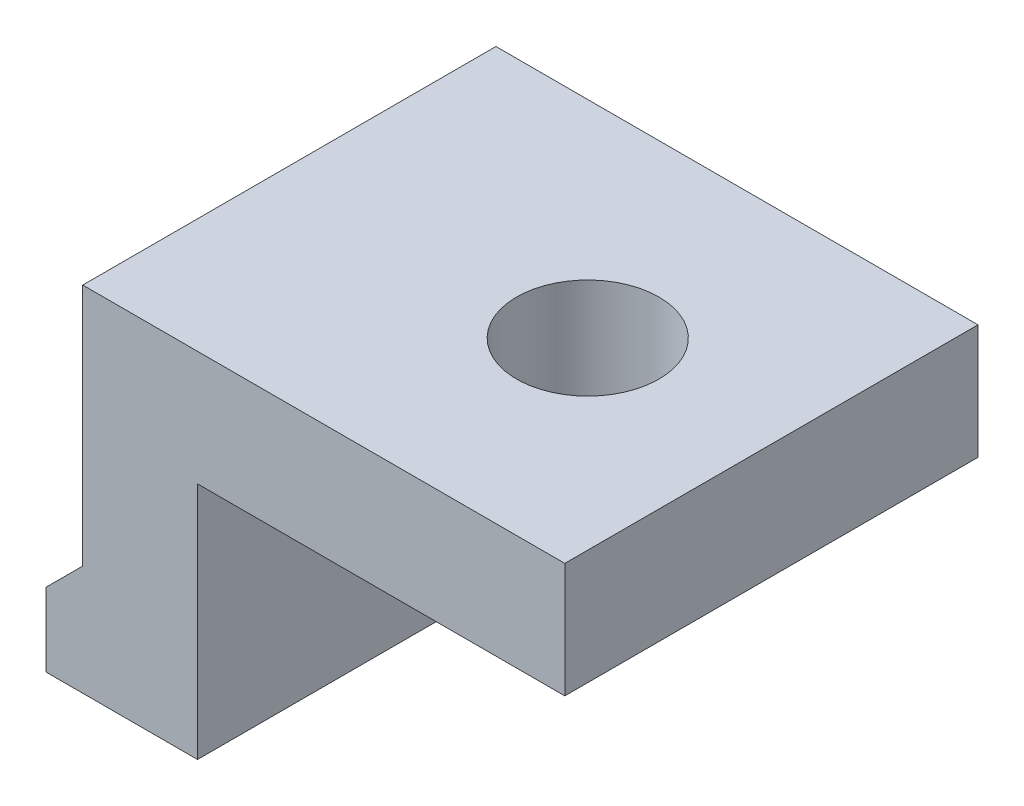
ISO-10303-21;
HEADER;
FILE_DESCRIPTION(('STEP AP214'),'2;1');
FILE_NAME('part.step','',(''),(''),'','','');
FILE_SCHEMA(('AUTOMOTIVE_DESIGN { 1 0 10303 214 1 1 1 1 }'));
ENDSEC;
DATA;
#1=APPLICATION_CONTEXT('core data for automotive mechanical design processes');
#2=APPLICATION_PROTOCOL_DEFINITION('international standard','automotive_design',2000,#1);
#3=PRODUCT_CONTEXT('',#1,'mechanical');
#4=PRODUCT('Part','Part','',(#3));
#5=PRODUCT_RELATED_PRODUCT_CATEGORY('part','',(#4));
#6=PRODUCT_DEFINITION_FORMATION('','',#4);
#7=PRODUCT_DEFINITION_CONTEXT('part definition',#1,'design');
#8=PRODUCT_DEFINITION('design','',#6,#7);
#9=PRODUCT_DEFINITION_SHAPE('','',#8);
#10=(LENGTH_UNIT() NAMED_UNIT(*) SI_UNIT(.MILLI.,.METRE.));
#11=(NAMED_UNIT(*) PLANE_ANGLE_UNIT() SI_UNIT($,.RADIAN.));
#12=(NAMED_UNIT(*) SI_UNIT($,.STERADIAN.) SOLID_ANGLE_UNIT());
#13=UNCERTAINTY_MEASURE_WITH_UNIT(LENGTH_MEASURE(1.E-05),#10,'distance_accuracy_value','');
#14=(GEOMETRIC_REPRESENTATION_CONTEXT(3) GLOBAL_UNCERTAINTY_ASSIGNED_CONTEXT((#13)) GLOBAL_UNIT_ASSIGNED_CONTEXT((#10,
#11,#12)) REPRESENTATION_CONTEXT('',''));
#15=CARTESIAN_POINT('',(0.,0.,0.));
#16=DIRECTION('',(0.,0.,1.));
#17=DIRECTION('',(1.,0.,0.));
#18=AXIS2_PLACEMENT_3D('',#15,#16,#17);
#19=CARTESIAN_POINT('',(8.,0.,9.));
#20=DIRECTION('',(1.,0.,0.));
#21=DIRECTION('',(0.,0.,-1.));
#22=AXIS2_PLACEMENT_3D('',#19,#20,#21);
#23=PLANE('',#22);
#24=DIRECTION('',(0.,-1.,0.));
#25=VECTOR('',#24,1.);
#26=CARTESIAN_POINT('',(8.,0.,0.));
#27=LINE('',#26,#25);
#28=CARTESIAN_POINT('',(8.,0.,0.));
#29=VERTEX_POINT('',#28);
#30=CARTESIAN_POINT('',(8.,-2.5,0.));
#31=VERTEX_POINT('',#30);
#32=EDGE_CURVE('E126',#29,#31,#27,.T.);
#33=ORIENTED_EDGE('',*,*,#32,.F.);
#34=DIRECTION('',(0.,0.,-1.));
#35=VECTOR('',#34,1.);
#36=CARTESIAN_POINT('',(8.,0.,9.));
#37=LINE('',#36,#35);
#38=CARTESIAN_POINT('',(8.,0.,9.));
#39=VERTEX_POINT('',#38);
#40=EDGE_CURVE('E11',#39,#29,#37,.T.);
#41=ORIENTED_EDGE('',*,*,#40,.F.);
#42=DIRECTION('',(0.,-1.,0.));
#43=VECTOR('',#42,1.);
#44=CARTESIAN_POINT('',(8.,0.,9.));
#45=LINE('',#44,#43);
#46=CARTESIAN_POINT('',(8.,-2.5,9.));
#47=VERTEX_POINT('',#46);
#48=EDGE_CURVE('E143',#39,#47,#45,.T.);
#49=ORIENTED_EDGE('',*,*,#48,.T.);
#50=DIRECTION('',(0.,0.,-1.));
#51=VECTOR('',#50,1.);
#52=CARTESIAN_POINT('',(8.,-2.5,9.));
#53=LINE('',#52,#51);
#54=EDGE_CURVE('E85',#47,#31,#53,.T.);
#55=ORIENTED_EDGE('',*,*,#54,.T.);
#56=EDGE_LOOP('',(#33,#41,#49,#55));
#57=FACE_BOUND('',#56,.T.);
#58=ADVANCED_FACE('F34',(#57),#23,.T.);
#59=CARTESIAN_POINT('',(0.,0.,9.));
#60=DIRECTION('',(0.,1.,0.));
#61=DIRECTION('',(0.,0.,1.));
#62=AXIS2_PLACEMENT_3D('',#59,#60,#61);
#63=PLANE('',#62);
#64=CARTESIAN_POINT('',(4.,0.,4.5));
#65=DIRECTION('',(0.,-1.,0.));
#66=DIRECTION('',(0.,0.,-1.));
#67=AXIS2_PLACEMENT_3D('',#64,#65,#66);
#68=CIRCLE('',#67,1.55);
#69=CARTESIAN_POINT('',(4.,0.,2.95));
#70=VERTEX_POINT('',#69);
#71=EDGE_CURVE('E130',#70,#70,#68,.T.);
#72=ORIENTED_EDGE('',*,*,#71,.T.);
#73=EDGE_LOOP('',(#72));
#74=FACE_BOUND('',#73,.T.);
#75=DIRECTION('',(1.,0.,0.));
#76=VECTOR('',#75,1.);
#77=CARTESIAN_POINT('',(0.,0.,0.));
#78=LINE('',#77,#76);
#79=CARTESIAN_POINT('',(-2.5,0.,0.));
#80=VERTEX_POINT('',#79);
#81=EDGE_CURVE('E129',#80,#29,#78,.T.);
#82=ORIENTED_EDGE('',*,*,#81,.F.);
#83=DIRECTION('',(0.,0.,-1.));
#84=VECTOR('',#83,1.);
#85=CARTESIAN_POINT('',(-2.5,0.,9.));
#86=LINE('',#85,#84);
#87=CARTESIAN_POINT('',(-2.5,0.,9.));
#88=VERTEX_POINT('',#87);
#89=EDGE_CURVE('E42',#88,#80,#86,.T.);
#90=ORIENTED_EDGE('',*,*,#89,.F.);
#91=DIRECTION('',(1.,0.,0.));
#92=VECTOR('',#91,1.);
#93=CARTESIAN_POINT('',(0.,0.,9.));
#94=LINE('',#93,#92);
#95=EDGE_CURVE('E167',#88,#39,#94,.T.);
#96=ORIENTED_EDGE('',*,*,#95,.T.);
#97=ORIENTED_EDGE('',*,*,#40,.T.);
#98=EDGE_LOOP('',(#82,#90,#96,#97));
#99=FACE_BOUND('',#98,.T.);
#100=ADVANCED_FACE('F166',(#74,#99),#63,.T.);
#101=CARTESIAN_POINT('',(-2.5,0.,9.));
#102=DIRECTION('',(1.,0.,0.));
#103=DIRECTION('',(0.,1.,0.));
#104=AXIS2_PLACEMENT_3D('',#101,#102,#103);
#105=PLANE('',#104);
#106=DIRECTION('',(0.,-1.,0.));
#107=VECTOR('',#106,1.);
#108=CARTESIAN_POINT('',(-2.5,0.,0.));
#109=LINE('',#108,#107);
#110=CARTESIAN_POINT('',(-2.5,-5.3,0.));
#111=VERTEX_POINT('',#110);
#112=EDGE_CURVE('E133',#80,#111,#109,.T.);
#113=ORIENTED_EDGE('',*,*,#112,.T.);
#114=DIRECTION('',(0.,0.,-1.));
#115=VECTOR('',#114,1.);
#116=CARTESIAN_POINT('',(-2.5,-5.3,9.));
#117=LINE('',#116,#115);
#118=CARTESIAN_POINT('',(-2.5,-5.3,9.));
#119=VERTEX_POINT('',#118);
#120=EDGE_CURVE('E150',#119,#111,#117,.T.);
#121=ORIENTED_EDGE('',*,*,#120,.F.);
#122=DIRECTION('',(0.,-1.,0.));
#123=VECTOR('',#122,1.);
#124=CARTESIAN_POINT('',(-2.5,0.,9.));
#125=LINE('',#124,#123);
#126=EDGE_CURVE('E157',#88,#119,#125,.T.);
#127=ORIENTED_EDGE('',*,*,#126,.F.);
#128=ORIENTED_EDGE('',*,*,#89,.T.);
#129=EDGE_LOOP('',(#113,#121,#127,#128));
#130=FACE_BOUND('',#129,.T.);
#131=ADVANCED_FACE('F155',(#130),#105,.F.);
#132=CARTESIAN_POINT('',(1.4,-1.40000000000001,9.));
#133=DIRECTION('',(0.707106781186547,-0.707106781186548,0.));
#134=DIRECTION('',(0.707106781186548,0.707106781186547,0.));
#135=AXIS2_PLACEMENT_3D('',#132,#133,#134);
#136=PLANE('',#135);
#137=DIRECTION('',(-0.707106781186548,-0.707106781186547,0.));
#138=VECTOR('',#137,1.);
#139=CARTESIAN_POINT('',(1.4,-1.40000000000001,0.));
#140=LINE('',#139,#138);
#141=CARTESIAN_POINT('',(-3.3,-6.1,0.));
#142=VERTEX_POINT('',#141);
#143=EDGE_CURVE('E135',#111,#142,#140,.T.);
#144=ORIENTED_EDGE('',*,*,#143,.T.);
#145=DIRECTION('',(0.,0.,-1.));
#146=VECTOR('',#145,1.);
#147=CARTESIAN_POINT('',(-3.3,-6.1,9.));
#148=LINE('',#147,#146);
#149=CARTESIAN_POINT('',(-3.3,-6.1,9.));
#150=VERTEX_POINT('',#149);
#151=EDGE_CURVE('E147',#150,#142,#148,.T.);
#152=ORIENTED_EDGE('',*,*,#151,.F.);
#153=DIRECTION('',(-0.707106781186548,-0.707106781186547,0.));
#154=VECTOR('',#153,1.);
#155=CARTESIAN_POINT('',(1.4,-1.40000000000001,9.));
#156=LINE('',#155,#154);
#157=EDGE_CURVE('E178',#119,#150,#156,.T.);
#158=ORIENTED_EDGE('',*,*,#157,.F.);
#159=ORIENTED_EDGE('',*,*,#120,.T.);
#160=EDGE_LOOP('',(#144,#152,#158,#159));
#161=FACE_BOUND('',#160,.T.);
#162=ADVANCED_FACE('F182',(#161),#136,.F.);
#163=CARTESIAN_POINT('',(-3.3,0.,9.));
#164=DIRECTION('',(1.,0.,0.));
#165=DIRECTION('',(0.,0.,-1.));
#166=AXIS2_PLACEMENT_3D('',#163,#164,#165);
#167=PLANE('',#166);
#168=DIRECTION('',(0.,-1.,0.));
#169=VECTOR('',#168,1.);
#170=CARTESIAN_POINT('',(-3.3,0.,0.));
#171=LINE('',#170,#169);
#172=CARTESIAN_POINT('',(-3.3,-7.7,0.));
#173=VERTEX_POINT('',#172);
#174=EDGE_CURVE('E137',#142,#173,#171,.T.);
#175=ORIENTED_EDGE('',*,*,#174,.T.);
#176=DIRECTION('',(0.,0.,-1.));
#177=VECTOR('',#176,1.);
#178=CARTESIAN_POINT('',(-3.3,-7.7,9.));
#179=LINE('',#178,#177);
#180=CARTESIAN_POINT('',(-3.3,-7.7,9.));
#181=VERTEX_POINT('',#180);
#182=EDGE_CURVE('E118',#181,#173,#179,.T.);
#183=ORIENTED_EDGE('',*,*,#182,.F.);
#184=DIRECTION('',(0.,-1.,0.));
#185=VECTOR('',#184,1.);
#186=CARTESIAN_POINT('',(-3.3,0.,9.));
#187=LINE('',#186,#185);
#188=EDGE_CURVE('E109',#150,#181,#187,.T.);
#189=ORIENTED_EDGE('',*,*,#188,.F.);
#190=ORIENTED_EDGE('',*,*,#151,.T.);
#191=EDGE_LOOP('',(#175,#183,#189,#190));
#192=FACE_BOUND('',#191,.T.);
#193=ADVANCED_FACE('F184',(#192),#167,.F.);
#194=CARTESIAN_POINT('',(0.,-7.7,9.));
#195=DIRECTION('',(0.,1.,0.));
#196=DIRECTION('',(0.,0.,1.));
#197=AXIS2_PLACEMENT_3D('',#194,#195,#196);
#198=PLANE('',#197);
#199=DIRECTION('',(1.,0.,0.));
#200=VECTOR('',#199,1.);
#201=CARTESIAN_POINT('',(0.,-7.7,0.));
#202=LINE('',#201,#200);
#203=CARTESIAN_POINT('',(0.,-7.7,0.));
#204=VERTEX_POINT('',#203);
#205=EDGE_CURVE('E117',#173,#204,#202,.T.);
#206=ORIENTED_EDGE('',*,*,#205,.T.);
#207=DIRECTION('',(0.,0.,-1.));
#208=VECTOR('',#207,1.);
#209=CARTESIAN_POINT('',(0.,-7.7,9.));
#210=LINE('',#209,#208);
#211=CARTESIAN_POINT('',(0.,-7.7,9.));
#212=VERTEX_POINT('',#211);
#213=EDGE_CURVE('E114',#212,#204,#210,.T.);
#214=ORIENTED_EDGE('',*,*,#213,.F.);
#215=DIRECTION('',(1.,0.,0.));
#216=VECTOR('',#215,1.);
#217=CARTESIAN_POINT('',(0.,-7.7,9.));
#218=LINE('',#217,#216);
#219=EDGE_CURVE('E103',#181,#212,#218,.T.);
#220=ORIENTED_EDGE('',*,*,#219,.F.);
#221=ORIENTED_EDGE('',*,*,#182,.T.);
#222=EDGE_LOOP('',(#206,#214,#220,#221));
#223=FACE_BOUND('',#222,.T.);
#224=ADVANCED_FACE('F115',(#223),#198,.F.);
#225=CARTESIAN_POINT('',(0.,0.,9.));
#226=DIRECTION('',(-1.,0.,0.));
#227=DIRECTION('',(0.,0.,1.));
#228=AXIS2_PLACEMENT_3D('',#225,#226,#227);
#229=PLANE('',#228);
#230=DIRECTION('',(0.,1.,0.));
#231=VECTOR('',#230,1.);
#232=CARTESIAN_POINT('',(0.,0.,0.));
#233=LINE('',#232,#231);
#234=CARTESIAN_POINT('',(0.,-2.5,0.));
#235=VERTEX_POINT('',#234);
#236=EDGE_CURVE('E78',#204,#235,#233,.T.);
#237=ORIENTED_EDGE('',*,*,#236,.T.);
#238=DIRECTION('',(0.,0.,-1.));
#239=VECTOR('',#238,1.);
#240=CARTESIAN_POINT('',(0.,-2.5,9.));
#241=LINE('',#240,#239);
#242=CARTESIAN_POINT('',(0.,-2.5,9.));
#243=VERTEX_POINT('',#242);
#244=EDGE_CURVE('E119',#243,#235,#241,.T.);
#245=ORIENTED_EDGE('',*,*,#244,.F.);
#246=DIRECTION('',(0.,1.,0.));
#247=VECTOR('',#246,1.);
#248=CARTESIAN_POINT('',(0.,0.,9.));
#249=LINE('',#248,#247);
#250=EDGE_CURVE('E107',#212,#243,#249,.T.);
#251=ORIENTED_EDGE('',*,*,#250,.F.);
#252=ORIENTED_EDGE('',*,*,#213,.T.);
#253=EDGE_LOOP('',(#237,#245,#251,#252));
#254=FACE_BOUND('',#253,.T.);
#255=ADVANCED_FACE('F121',(#254),#229,.F.);
#256=CARTESIAN_POINT('',(0.,-2.5,9.));
#257=DIRECTION('',(0.,1.,0.));
#258=DIRECTION('',(0.,0.,1.));
#259=AXIS2_PLACEMENT_3D('',#256,#257,#258);
#260=PLANE('',#259);
#261=CARTESIAN_POINT('',(4.,-2.5,4.5));
#262=DIRECTION('',(0.,-1.,0.));
#263=DIRECTION('',(0.,0.,-1.));
#264=AXIS2_PLACEMENT_3D('',#261,#262,#263);
#265=CIRCLE('',#264,1.55);
#266=CARTESIAN_POINT('',(4.,-2.5,2.95));
#267=VERTEX_POINT('',#266);
#268=EDGE_CURVE('E174',#267,#267,#265,.T.);
#269=ORIENTED_EDGE('',*,*,#268,.F.);
#270=EDGE_LOOP('',(#269));
#271=FACE_BOUND('',#270,.T.);
#272=DIRECTION('',(1.,0.,0.));
#273=VECTOR('',#272,1.);
#274=CARTESIAN_POINT('',(0.,-2.5,0.));
#275=LINE('',#274,#273);
#276=EDGE_CURVE('E141',#235,#31,#275,.T.);
#277=ORIENTED_EDGE('',*,*,#276,.T.);
#278=ORIENTED_EDGE('',*,*,#54,.F.);
#279=DIRECTION('',(1.,0.,0.));
#280=VECTOR('',#279,1.);
#281=CARTESIAN_POINT('',(0.,-2.5,9.));
#282=LINE('',#281,#280);
#283=EDGE_CURVE('E50',#243,#47,#282,.T.);
#284=ORIENTED_EDGE('',*,*,#283,.F.);
#285=ORIENTED_EDGE('',*,*,#244,.T.);
#286=EDGE_LOOP('',(#277,#278,#284,#285));
#287=FACE_BOUND('',#286,.T.);
#288=ADVANCED_FACE('F170',(#271,#287),#260,.F.);
#289=CARTESIAN_POINT('',(0.,0.,9.));
#290=DIRECTION('',(0.,0.,1.));
#291=DIRECTION('',(1.,0.,0.));
#292=AXIS2_PLACEMENT_3D('',#289,#290,#291);
#293=PLANE('',#292);
#294=ORIENTED_EDGE('',*,*,#48,.F.);
#295=ORIENTED_EDGE('',*,*,#95,.F.);
#296=ORIENTED_EDGE('',*,*,#126,.T.);
#297=ORIENTED_EDGE('',*,*,#157,.T.);
#298=ORIENTED_EDGE('',*,*,#188,.T.);
#299=ORIENTED_EDGE('',*,*,#219,.T.);
#300=ORIENTED_EDGE('',*,*,#250,.T.);
#301=ORIENTED_EDGE('',*,*,#283,.T.);
#302=EDGE_LOOP('',(#294,#295,#296,#297,#298,#299,#300,#301));
#303=FACE_BOUND('',#302,.T.);
#304=ADVANCED_FACE('F105',(#303),#293,.T.);
#305=CARTESIAN_POINT('',(0.,0.,0.));
#306=DIRECTION('',(0.,0.,1.));
#307=DIRECTION('',(1.,0.,0.));
#308=AXIS2_PLACEMENT_3D('',#305,#306,#307);
#309=PLANE('',#308);
#310=ORIENTED_EDGE('',*,*,#32,.T.);
#311=ORIENTED_EDGE('',*,*,#276,.F.);
#312=ORIENTED_EDGE('',*,*,#236,.F.);
#313=ORIENTED_EDGE('',*,*,#205,.F.);
#314=ORIENTED_EDGE('',*,*,#174,.F.);
#315=ORIENTED_EDGE('',*,*,#143,.F.);
#316=ORIENTED_EDGE('',*,*,#112,.F.);
#317=ORIENTED_EDGE('',*,*,#81,.T.);
#318=EDGE_LOOP('',(#310,#311,#312,#313,#314,#315,#316,#317));
#319=FACE_BOUND('',#318,.T.);
#320=ADVANCED_FACE('F164',(#319),#309,.F.);
#321=CARTESIAN_POINT('',(4.,0.,4.5));
#322=DIRECTION('',(0.,-1.,0.));
#323=DIRECTION('',(0.,0.,-1.));
#324=AXIS2_PLACEMENT_3D('',#321,#322,#323);
#325=CYLINDRICAL_SURFACE('',#324,1.55);
#326=ORIENTED_EDGE('',*,*,#71,.F.);
#327=EDGE_LOOP('',(#326));
#328=FACE_BOUND('',#327,.T.);
#329=ORIENTED_EDGE('',*,*,#268,.T.);
#330=EDGE_LOOP('',(#329));
#331=FACE_BOUND('',#330,.T.);
#332=ADVANCED_FACE('F208',(#328,#331),#325,.F.);
#333=CLOSED_SHELL('',(#58,#100,#131,#162,#193,#224,#255,#288,#304,#320,#332));
#334=MANIFOLD_SOLID_BREP('B2',#333);
#335=ADVANCED_BREP_SHAPE_REPRESENTATION('',(#18,#334),#14);
#336=SHAPE_DEFINITION_REPRESENTATION(#9,#335);
ENDSEC;
END-ISO-10303-21;
